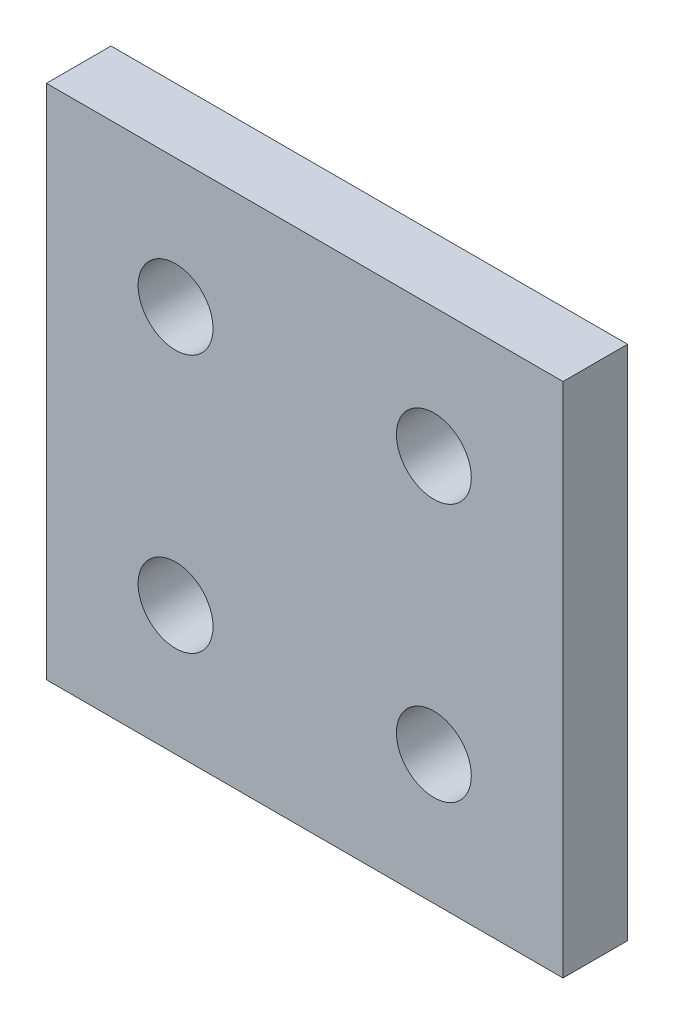
ISO-10303-21;
HEADER;
FILE_DESCRIPTION(('STEP AP214'),'2;1');
FILE_NAME('part.step','',(''),(''),'','','');
FILE_SCHEMA(('AUTOMOTIVE_DESIGN { 1 0 10303 214 1 1 1 1 }'));
ENDSEC;
DATA;
#1=APPLICATION_CONTEXT('core data for automotive mechanical design processes');
#2=APPLICATION_PROTOCOL_DEFINITION('international standard','automotive_design',2000,#1);
#3=PRODUCT_CONTEXT('',#1,'mechanical');
#4=PRODUCT('Part','Part','',(#3));
#5=PRODUCT_RELATED_PRODUCT_CATEGORY('part','',(#4));
#6=PRODUCT_DEFINITION_FORMATION('','',#4);
#7=PRODUCT_DEFINITION_CONTEXT('part definition',#1,'design');
#8=PRODUCT_DEFINITION('design','',#6,#7);
#9=PRODUCT_DEFINITION_SHAPE('','',#8);
#10=(LENGTH_UNIT() NAMED_UNIT(*) SI_UNIT(.MILLI.,.METRE.));
#11=(NAMED_UNIT(*) PLANE_ANGLE_UNIT() SI_UNIT($,.RADIAN.));
#12=(NAMED_UNIT(*) SI_UNIT($,.STERADIAN.) SOLID_ANGLE_UNIT());
#13=UNCERTAINTY_MEASURE_WITH_UNIT(LENGTH_MEASURE(1.E-05),#10,'distance_accuracy_value','');
#14=(GEOMETRIC_REPRESENTATION_CONTEXT(3) GLOBAL_UNCERTAINTY_ASSIGNED_CONTEXT((#13)) GLOBAL_UNIT_ASSIGNED_CONTEXT((#10,
#11,#12)) REPRESENTATION_CONTEXT('',''));
#15=CARTESIAN_POINT('',(0.,0.,0.));
#16=DIRECTION('',(0.,0.,1.));
#17=DIRECTION('',(1.,0.,0.));
#18=AXIS2_PLACEMENT_3D('',#15,#16,#17);
#19=CARTESIAN_POINT('',(0.,0.,5.));
#20=DIRECTION('',(0.,0.,-1.));
#21=DIRECTION('',(-1.,0.,0.));
#22=AXIS2_PLACEMENT_3D('',#19,#20,#21);
#23=PLANE('',#22);
#24=CARTESIAN_POINT('',(10.,30.,5.));
#25=DIRECTION('',(0.,0.,1.));
#26=DIRECTION('',(1.,0.,0.));
#27=AXIS2_PLACEMENT_3D('',#24,#25,#26);
#28=CIRCLE('',#27,2.9);
#29=CARTESIAN_POINT('',(12.9,30.,5.));
#30=VERTEX_POINT('',#29);
#31=EDGE_CURVE('E131',#30,#30,#28,.T.);
#32=ORIENTED_EDGE('',*,*,#31,.F.);
#33=EDGE_LOOP('',(#32));
#34=FACE_BOUND('',#33,.T.);
#35=CARTESIAN_POINT('',(30.,30.,5.));
#36=DIRECTION('',(0.,0.,1.));
#37=DIRECTION('',(1.,0.,0.));
#38=AXIS2_PLACEMENT_3D('',#35,#36,#37);
#39=CIRCLE('',#38,2.9);
#40=CARTESIAN_POINT('',(32.9,30.,5.));
#41=VERTEX_POINT('',#40);
#42=EDGE_CURVE('E125',#41,#41,#39,.T.);
#43=ORIENTED_EDGE('',*,*,#42,.F.);
#44=EDGE_LOOP('',(#43));
#45=FACE_BOUND('',#44,.T.);
#46=CARTESIAN_POINT('',(30.0000000000002,10.,5.));
#47=DIRECTION('',(0.,0.,1.));
#48=DIRECTION('',(1.,0.,0.));
#49=AXIS2_PLACEMENT_3D('',#46,#47,#48);
#50=CIRCLE('',#49,2.9);
#51=CARTESIAN_POINT('',(32.9000000000002,10.,5.));
#52=VERTEX_POINT('',#51);
#53=EDGE_CURVE('E119',#52,#52,#50,.T.);
#54=ORIENTED_EDGE('',*,*,#53,.F.);
#55=EDGE_LOOP('',(#54));
#56=FACE_BOUND('',#55,.T.);
#57=DIRECTION('',(0.,-1.,0.));
#58=VECTOR('',#57,1.);
#59=CARTESIAN_POINT('',(0.,0.,5.));
#60=LINE('',#59,#58);
#61=CARTESIAN_POINT('',(0.,40.,5.));
#62=VERTEX_POINT('',#61);
#63=CARTESIAN_POINT('',(0.,0.,5.));
#64=VERTEX_POINT('',#63);
#65=EDGE_CURVE('E85',#62,#64,#60,.T.);
#66=ORIENTED_EDGE('',*,*,#65,.T.);
#67=DIRECTION('',(1.,0.,0.));
#68=VECTOR('',#67,1.);
#69=CARTESIAN_POINT('',(0.,0.,5.));
#70=LINE('',#69,#68);
#71=CARTESIAN_POINT('',(40.,0.,5.));
#72=VERTEX_POINT('',#71);
#73=EDGE_CURVE('E80',#64,#72,#70,.T.);
#74=ORIENTED_EDGE('',*,*,#73,.T.);
#75=DIRECTION('',(0.,1.,0.));
#76=VECTOR('',#75,1.);
#77=CARTESIAN_POINT('',(40.,0.,5.));
#78=LINE('',#77,#76);
#79=CARTESIAN_POINT('',(40.,40.,5.));
#80=VERTEX_POINT('',#79);
#81=EDGE_CURVE('E83',#72,#80,#78,.T.);
#82=ORIENTED_EDGE('',*,*,#81,.T.);
#83=DIRECTION('',(-1.,0.,0.));
#84=VECTOR('',#83,1.);
#85=CARTESIAN_POINT('',(0.,40.,5.));
#86=LINE('',#85,#84);
#87=EDGE_CURVE('E50',#80,#62,#86,.T.);
#88=ORIENTED_EDGE('',*,*,#87,.T.);
#89=EDGE_LOOP('',(#66,#74,#82,#88));
#90=FACE_BOUND('',#89,.T.);
#91=CARTESIAN_POINT('',(10.0000000000002,10.,5.));
#92=DIRECTION('',(0.,0.,1.));
#93=DIRECTION('',(1.,0.,0.));
#94=AXIS2_PLACEMENT_3D('',#91,#92,#93);
#95=CIRCLE('',#94,2.9);
#96=CARTESIAN_POINT('',(12.9000000000002,10.,5.));
#97=VERTEX_POINT('',#96);
#98=EDGE_CURVE('E113',#97,#97,#95,.T.);
#99=ORIENTED_EDGE('',*,*,#98,.F.);
#100=EDGE_LOOP('',(#99));
#101=FACE_BOUND('',#100,.T.);
#102=ADVANCED_FACE('F33',(#34,#45,#56,#90,#101),#23,.F.);
#103=CARTESIAN_POINT('',(0.,0.,5.));
#104=DIRECTION('',(1.,0.,0.));
#105=DIRECTION('',(0.,0.,-1.));
#106=AXIS2_PLACEMENT_3D('',#103,#104,#105);
#107=PLANE('',#106);
#108=DIRECTION('',(0.,-1.,0.));
#109=VECTOR('',#108,1.);
#110=CARTESIAN_POINT('',(0.,0.,0.));
#111=LINE('',#110,#109);
#112=CARTESIAN_POINT('',(0.,40.,0.));
#113=VERTEX_POINT('',#112);
#114=CARTESIAN_POINT('',(0.,0.,0.));
#115=VERTEX_POINT('',#114);
#116=EDGE_CURVE('E97',#113,#115,#111,.T.);
#117=ORIENTED_EDGE('',*,*,#116,.T.);
#118=DIRECTION('',(0.,0.,-1.));
#119=VECTOR('',#118,1.);
#120=CARTESIAN_POINT('',(0.,0.,5.));
#121=LINE('',#120,#119);
#122=EDGE_CURVE('E11',#64,#115,#121,.T.);
#123=ORIENTED_EDGE('',*,*,#122,.F.);
#124=ORIENTED_EDGE('',*,*,#65,.F.);
#125=DIRECTION('',(0.,0.,-1.));
#126=VECTOR('',#125,1.);
#127=CARTESIAN_POINT('',(0.,40.,5.));
#128=LINE('',#127,#126);
#129=EDGE_CURVE('E93',#62,#113,#128,.T.);
#130=ORIENTED_EDGE('',*,*,#129,.T.);
#131=EDGE_LOOP('',(#117,#123,#124,#130));
#132=FACE_BOUND('',#131,.T.);
#133=ADVANCED_FACE('F35',(#132),#107,.F.);
#134=CARTESIAN_POINT('',(0.,0.,5.));
#135=DIRECTION('',(0.,1.,0.));
#136=DIRECTION('',(0.,0.,1.));
#137=AXIS2_PLACEMENT_3D('',#134,#135,#136);
#138=PLANE('',#137);
#139=DIRECTION('',(1.,0.,0.));
#140=VECTOR('',#139,1.);
#141=CARTESIAN_POINT('',(0.,0.,0.));
#142=LINE('',#141,#140);
#143=CARTESIAN_POINT('',(40.,0.,0.));
#144=VERTEX_POINT('',#143);
#145=EDGE_CURVE('E89',#115,#144,#142,.T.);
#146=ORIENTED_EDGE('',*,*,#145,.T.);
#147=DIRECTION('',(0.,0.,-1.));
#148=VECTOR('',#147,1.);
#149=CARTESIAN_POINT('',(40.,0.,5.));
#150=LINE('',#149,#148);
#151=EDGE_CURVE('E42',#72,#144,#150,.T.);
#152=ORIENTED_EDGE('',*,*,#151,.F.);
#153=ORIENTED_EDGE('',*,*,#73,.F.);
#154=ORIENTED_EDGE('',*,*,#122,.T.);
#155=EDGE_LOOP('',(#146,#152,#153,#154));
#156=FACE_BOUND('',#155,.T.);
#157=ADVANCED_FACE('F88',(#156),#138,.F.);
#158=CARTESIAN_POINT('',(40.,0.,5.));
#159=DIRECTION('',(-1.,0.,0.));
#160=DIRECTION('',(0.,0.,1.));
#161=AXIS2_PLACEMENT_3D('',#158,#159,#160);
#162=PLANE('',#161);
#163=DIRECTION('',(0.,1.,0.));
#164=VECTOR('',#163,1.);
#165=CARTESIAN_POINT('',(40.,0.,0.));
#166=LINE('',#165,#164);
#167=CARTESIAN_POINT('',(40.,40.,0.));
#168=VERTEX_POINT('',#167);
#169=EDGE_CURVE('E67',#144,#168,#166,.T.);
#170=ORIENTED_EDGE('',*,*,#169,.T.);
#171=DIRECTION('',(0.,0.,-1.));
#172=VECTOR('',#171,1.);
#173=CARTESIAN_POINT('',(40.,40.,5.));
#174=LINE('',#173,#172);
#175=EDGE_CURVE('E90',#80,#168,#174,.T.);
#176=ORIENTED_EDGE('',*,*,#175,.F.);
#177=ORIENTED_EDGE('',*,*,#81,.F.);
#178=ORIENTED_EDGE('',*,*,#151,.T.);
#179=EDGE_LOOP('',(#170,#176,#177,#178));
#180=FACE_BOUND('',#179,.T.);
#181=ADVANCED_FACE('F91',(#180),#162,.F.);
#182=CARTESIAN_POINT('',(0.,40.,5.));
#183=DIRECTION('',(0.,-1.,0.));
#184=DIRECTION('',(0.,0.,-1.));
#185=AXIS2_PLACEMENT_3D('',#182,#183,#184);
#186=PLANE('',#185);
#187=DIRECTION('',(-1.,0.,0.));
#188=VECTOR('',#187,1.);
#189=CARTESIAN_POINT('',(0.,40.,0.));
#190=LINE('',#189,#188);
#191=EDGE_CURVE('E73',#168,#113,#190,.T.);
#192=ORIENTED_EDGE('',*,*,#191,.T.);
#193=ORIENTED_EDGE('',*,*,#129,.F.);
#194=ORIENTED_EDGE('',*,*,#87,.F.);
#195=ORIENTED_EDGE('',*,*,#175,.T.);
#196=EDGE_LOOP('',(#192,#193,#194,#195));
#197=FACE_BOUND('',#196,.T.);
#198=ADVANCED_FACE('F105',(#197),#186,.F.);
#199=CARTESIAN_POINT('',(0.,0.,0.));
#200=DIRECTION('',(0.,0.,-1.));
#201=DIRECTION('',(-1.,0.,0.));
#202=AXIS2_PLACEMENT_3D('',#199,#200,#201);
#203=PLANE('',#202);
#204=CARTESIAN_POINT('',(10.,30.,0.));
#205=DIRECTION('',(0.,0.,1.));
#206=DIRECTION('',(1.,0.,0.));
#207=AXIS2_PLACEMENT_3D('',#204,#205,#206);
#208=CIRCLE('',#207,2.9);
#209=CARTESIAN_POINT('',(12.9,30.,0.));
#210=VERTEX_POINT('',#209);
#211=EDGE_CURVE('E128',#210,#210,#208,.T.);
#212=ORIENTED_EDGE('',*,*,#211,.T.);
#213=EDGE_LOOP('',(#212));
#214=FACE_BOUND('',#213,.T.);
#215=CARTESIAN_POINT('',(30.,30.,0.));
#216=DIRECTION('',(0.,0.,1.));
#217=DIRECTION('',(1.,0.,0.));
#218=AXIS2_PLACEMENT_3D('',#215,#216,#217);
#219=CIRCLE('',#218,2.9);
#220=CARTESIAN_POINT('',(32.9,30.,0.));
#221=VERTEX_POINT('',#220);
#222=EDGE_CURVE('E122',#221,#221,#219,.T.);
#223=ORIENTED_EDGE('',*,*,#222,.T.);
#224=EDGE_LOOP('',(#223));
#225=FACE_BOUND('',#224,.T.);
#226=CARTESIAN_POINT('',(30.0000000000002,10.,0.));
#227=DIRECTION('',(0.,0.,1.));
#228=DIRECTION('',(1.,0.,0.));
#229=AXIS2_PLACEMENT_3D('',#226,#227,#228);
#230=CIRCLE('',#229,2.9);
#231=CARTESIAN_POINT('',(32.9000000000002,10.,0.));
#232=VERTEX_POINT('',#231);
#233=EDGE_CURVE('E116',#232,#232,#230,.T.);
#234=ORIENTED_EDGE('',*,*,#233,.T.);
#235=EDGE_LOOP('',(#234));
#236=FACE_BOUND('',#235,.T.);
#237=CARTESIAN_POINT('',(10.0000000000002,10.,0.));
#238=DIRECTION('',(0.,0.,1.));
#239=DIRECTION('',(1.,0.,0.));
#240=AXIS2_PLACEMENT_3D('',#237,#238,#239);
#241=CIRCLE('',#240,2.9);
#242=CARTESIAN_POINT('',(12.9000000000002,10.,0.));
#243=VERTEX_POINT('',#242);
#244=EDGE_CURVE('E100',#243,#243,#241,.T.);
#245=ORIENTED_EDGE('',*,*,#244,.T.);
#246=EDGE_LOOP('',(#245));
#247=FACE_BOUND('',#246,.T.);
#248=ORIENTED_EDGE('',*,*,#116,.F.);
#249=ORIENTED_EDGE('',*,*,#191,.F.);
#250=ORIENTED_EDGE('',*,*,#169,.F.);
#251=ORIENTED_EDGE('',*,*,#145,.F.);
#252=EDGE_LOOP('',(#248,#249,#250,#251));
#253=FACE_BOUND('',#252,.T.);
#254=ADVANCED_FACE('F108',(#214,#225,#236,#247,#253),#203,.T.);
#255=CARTESIAN_POINT('',(10.0000000000002,10.,5.));
#256=DIRECTION('',(0.,0.,1.));
#257=DIRECTION('',(1.,0.,0.));
#258=AXIS2_PLACEMENT_3D('',#255,#256,#257);
#259=CYLINDRICAL_SURFACE('',#258,2.9);
#260=ORIENTED_EDGE('',*,*,#244,.F.);
#261=EDGE_LOOP('',(#260));
#262=FACE_BOUND('',#261,.T.);
#263=ORIENTED_EDGE('',*,*,#98,.T.);
#264=EDGE_LOOP('',(#263));
#265=FACE_BOUND('',#264,.T.);
#266=ADVANCED_FACE('F147',(#262,#265),#259,.F.);
#267=CARTESIAN_POINT('',(30.0000000000002,10.,5.));
#268=DIRECTION('',(0.,0.,1.));
#269=DIRECTION('',(1.,0.,0.));
#270=AXIS2_PLACEMENT_3D('',#267,#268,#269);
#271=CYLINDRICAL_SURFACE('',#270,2.9);
#272=ORIENTED_EDGE('',*,*,#233,.F.);
#273=EDGE_LOOP('',(#272));
#274=FACE_BOUND('',#273,.T.);
#275=ORIENTED_EDGE('',*,*,#53,.T.);
#276=EDGE_LOOP('',(#275));
#277=FACE_BOUND('',#276,.T.);
#278=ADVANCED_FACE('F144',(#274,#277),#271,.F.);
#279=CARTESIAN_POINT('',(30.,30.,5.));
#280=DIRECTION('',(0.,0.,1.));
#281=DIRECTION('',(1.,0.,0.));
#282=AXIS2_PLACEMENT_3D('',#279,#280,#281);
#283=CYLINDRICAL_SURFACE('',#282,2.9);
#284=ORIENTED_EDGE('',*,*,#222,.F.);
#285=EDGE_LOOP('',(#284));
#286=FACE_BOUND('',#285,.T.);
#287=ORIENTED_EDGE('',*,*,#42,.T.);
#288=EDGE_LOOP('',(#287));
#289=FACE_BOUND('',#288,.T.);
#290=ADVANCED_FACE('F146',(#286,#289),#283,.F.);
#291=CARTESIAN_POINT('',(10.,30.,5.));
#292=DIRECTION('',(0.,0.,1.));
#293=DIRECTION('',(1.,0.,0.));
#294=AXIS2_PLACEMENT_3D('',#291,#292,#293);
#295=CYLINDRICAL_SURFACE('',#294,2.9);
#296=ORIENTED_EDGE('',*,*,#211,.F.);
#297=EDGE_LOOP('',(#296));
#298=FACE_BOUND('',#297,.T.);
#299=ORIENTED_EDGE('',*,*,#31,.T.);
#300=EDGE_LOOP('',(#299));
#301=FACE_BOUND('',#300,.T.);
#302=ADVANCED_FACE('F135',(#298,#301),#295,.F.);
#303=CLOSED_SHELL('',(#102,#133,#157,#181,#198,#254,#266,#278,#290,#302));
#304=MANIFOLD_SOLID_BREP('B2',#303);
#305=ADVANCED_BREP_SHAPE_REPRESENTATION('',(#18,#304),#14);
#306=SHAPE_DEFINITION_REPRESENTATION(#9,#305);
ENDSEC;
END-ISO-10303-21;
